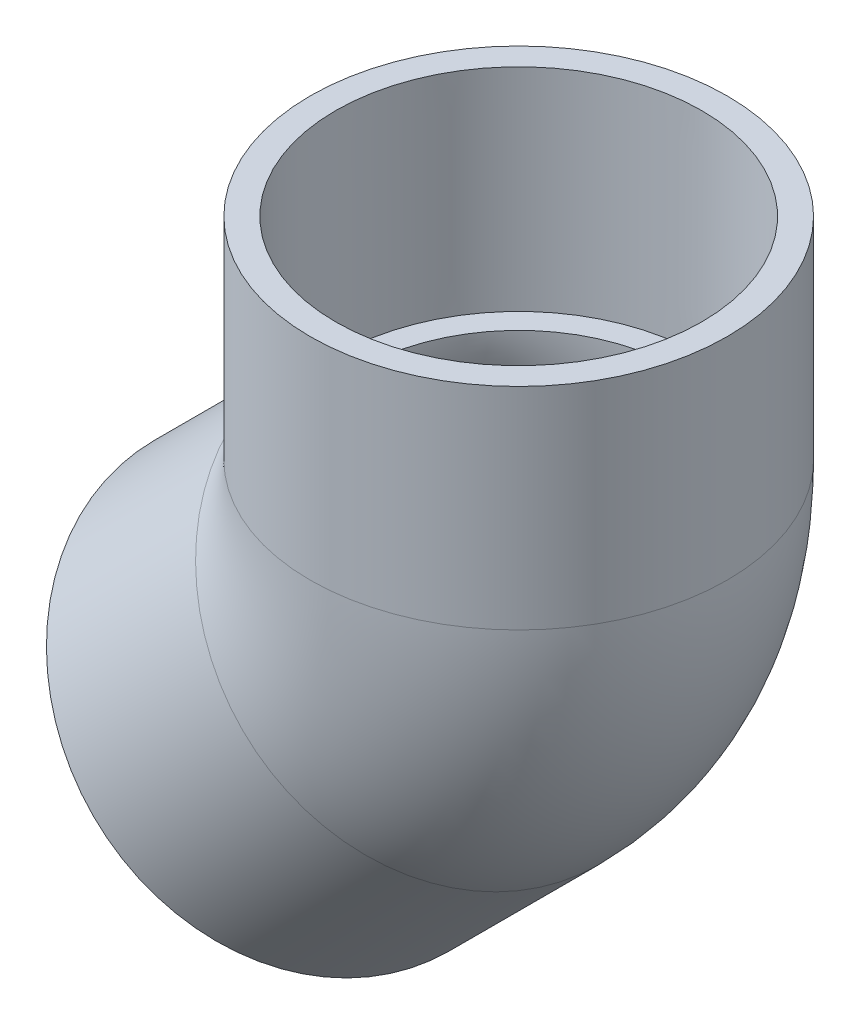
ISO-10303-21;
HEADER;
FILE_DESCRIPTION(('STEP AP214'),'2;1');
FILE_NAME('part.step','',(''),(''),'','','');
FILE_SCHEMA(('AUTOMOTIVE_DESIGN { 1 0 10303 214 1 1 1 1 }'));
ENDSEC;
DATA;
#1=APPLICATION_CONTEXT('core data for automotive mechanical design processes');
#2=APPLICATION_PROTOCOL_DEFINITION('international standard','automotive_design',2000,#1);
#3=PRODUCT_CONTEXT('',#1,'mechanical');
#4=PRODUCT('Part','Part','',(#3));
#5=PRODUCT_RELATED_PRODUCT_CATEGORY('part','',(#4));
#6=PRODUCT_DEFINITION_FORMATION('','',#4);
#7=PRODUCT_DEFINITION_CONTEXT('part definition',#1,'design');
#8=PRODUCT_DEFINITION('design','',#6,#7);
#9=PRODUCT_DEFINITION_SHAPE('','',#8);
#10=(LENGTH_UNIT() NAMED_UNIT(*) SI_UNIT(.MILLI.,.METRE.));
#11=(NAMED_UNIT(*) PLANE_ANGLE_UNIT() SI_UNIT($,.RADIAN.));
#12=(NAMED_UNIT(*) SI_UNIT($,.STERADIAN.) SOLID_ANGLE_UNIT());
#13=UNCERTAINTY_MEASURE_WITH_UNIT(LENGTH_MEASURE(1.E-05),#10,'distance_accuracy_value','');
#14=(GEOMETRIC_REPRESENTATION_CONTEXT(3) GLOBAL_UNCERTAINTY_ASSIGNED_CONTEXT((#13)) GLOBAL_UNIT_ASSIGNED_CONTEXT((#10,
#11,#12)) REPRESENTATION_CONTEXT('',''));
#15=CARTESIAN_POINT('',(0.,0.,0.));
#16=DIRECTION('',(0.,0.,1.));
#17=DIRECTION('',(1.,0.,0.));
#18=AXIS2_PLACEMENT_3D('',#15,#16,#17);
#19=CARTESIAN_POINT('',(-11.50595315512,-60.3360958134333,0.));
#20=DIRECTION('',(-0.707106781186549,-0.707106781186546,0.));
#21=DIRECTION('',(0.707106781186546,-0.707106781186549,0.));
#22=AXIS2_PLACEMENT_3D('',#19,#20,#21);
#23=PLANE('',#22);
#24=CARTESIAN_POINT('',(-35.9210244842767,-35.9210244842766,0.));
#25=DIRECTION('',(-0.707106781186549,-0.707106781186546,0.));
#26=DIRECTION('',(0.707106781186546,-0.707106781186549,0.));
#27=AXIS2_PLACEMENT_3D('',#24,#25,#26);
#28=CIRCLE('',#27,34.528125);
#29=CARTESIAN_POINT('',(-11.50595315512,-60.3360958134333,0.));
#30=VERTEX_POINT('',#29);
#31=EDGE_CURVE('E49',#30,#30,#28,.T.);
#32=ORIENTED_EDGE('',*,*,#31,.T.);
#33=EDGE_LOOP('',(#32));
#34=FACE_BOUND('',#33,.T.);
#35=CARTESIAN_POINT('',(-35.9210244842767,-35.9210244842766,0.));
#36=DIRECTION('',(-0.707106781186549,-0.707106781186546,0.));
#37=DIRECTION('',(0.707106781186546,-0.707106781186549,0.));
#38=AXIS2_PLACEMENT_3D('',#35,#36,#37);
#39=CIRCLE('',#38,30.3149);
#40=CARTESIAN_POINT('',(-14.4851531232846,-57.3568958452686,0.));
#41=VERTEX_POINT('',#40);
#42=EDGE_CURVE('E36',#41,#41,#39,.T.);
#43=ORIENTED_EDGE('',*,*,#42,.F.);
#44=EDGE_LOOP('',(#43));
#45=FACE_BOUND('',#44,.T.);
#46=ADVANCED_FACE('F30',(#34,#45),#23,.T.);
#47=CARTESIAN_POINT('',(-11.2253201513365,-11.2253201513364,0.));
#48=DIRECTION('',(-0.707106781186549,-0.707106781186546,0.));
#49=DIRECTION('',(0.707106781186546,-0.707106781186549,0.));
#50=AXIS2_PLACEMENT_3D('',#47,#48,#49);
#51=CONICAL_SURFACE('',#50,30.0863,0.00654536107227494);
#52=ORIENTED_EDGE('',*,*,#42,.T.);
#53=EDGE_LOOP('',(#52));
#54=FACE_BOUND('',#53,.T.);
#55=CARTESIAN_POINT('',(-11.2253201513365,-11.2253201513364,0.));
#56=DIRECTION('',(-0.707106781186549,-0.707106781186546,0.));
#57=DIRECTION('',(0.707106781186546,-0.707106781186549,0.));
#58=AXIS2_PLACEMENT_3D('',#55,#56,#57);
#59=CIRCLE('',#58,30.0863);
#60=CARTESIAN_POINT('',(10.0489065994763,-32.4995469021493,0.));
#61=VERTEX_POINT('',#60);
#62=EDGE_CURVE('E40',#61,#61,#59,.T.);
#63=ORIENTED_EDGE('',*,*,#62,.F.);
#64=EDGE_LOOP('',(#63));
#65=FACE_BOUND('',#64,.T.);
#66=ADVANCED_FACE('F81',(#54,#65),#51,.F.);
#67=CARTESIAN_POINT('',(-35.9210244842767,-35.9210244842766,0.));
#68=DIRECTION('',(-0.707106781186549,-0.707106781186546,0.));
#69=DIRECTION('',(0.707106781186546,-0.707106781186549,0.));
#70=AXIS2_PLACEMENT_3D('',#67,#68,#69);
#71=CYLINDRICAL_SURFACE('',#70,34.528125);
#72=CARTESIAN_POINT('',(-11.2253201513365,-11.2253201513364,0.));
#73=DIRECTION('',(-0.707106781186549,-0.707106781186546,0.));
#74=DIRECTION('',(0.707106781186546,-0.707106781186549,0.));
#75=AXIS2_PLACEMENT_3D('',#72,#73,#74);
#76=CIRCLE('',#75,34.528125);
#77=CARTESIAN_POINT('',(13.1897511778203,-35.6403914804932,0.));
#78=VERTEX_POINT('',#77);
#79=EDGE_CURVE('E44',#78,#78,#76,.T.);
#80=ORIENTED_EDGE('',*,*,#79,.T.);
#81=EDGE_LOOP('',(#80));
#82=FACE_BOUND('',#81,.T.);
#83=ORIENTED_EDGE('',*,*,#31,.F.);
#84=EDGE_LOOP('',(#83));
#85=FACE_BOUND('',#84,.T.);
#86=ADVANCED_FACE('F86',(#82,#85),#71,.T.);
#87=CARTESIAN_POINT('',(-38.3256403026728,15.875,0.));
#88=DIRECTION('',(0.,0.,-1.));
#89=DIRECTION('',(-1.,0.,0.));
#90=AXIS2_PLACEMENT_3D('',#87,#88,#89);
#91=TOROIDAL_SURFACE('',#90,38.3256403026728,26.2509);
#92=CARTESIAN_POINT('',(0.,15.875,0.));
#93=DIRECTION('',(0.,1.,0.));
#94=DIRECTION('',(-1.,0.,0.));
#95=AXIS2_PLACEMENT_3D('',#92,#93,#94);
#96=CIRCLE('',#95,26.2509);
#97=CARTESIAN_POINT('',(26.2509,15.875,0.));
#98=VERTEX_POINT('',#97);
#99=EDGE_CURVE('E55',#98,#98,#96,.T.);
#100=CARTESIAN_POINT('',(-11.2253201513365,-11.2253201513364,0.));
#101=DIRECTION('',(0.707106781186549,0.707106781186546,0.));
#102=DIRECTION('',(-0.707106781186546,0.707106781186549,0.));
#103=AXIS2_PLACEMENT_3D('',#100,#101,#102);
#104=CIRCLE('',#103,26.2509);
#105=CARTESIAN_POINT('',(7.33686925091345,-29.7875095535864,0.));
#106=VERTEX_POINT('',#105);
#107=EDGE_CURVE('E58',#106,#106,#104,.T.);
#108=CARTESIAN_POINT('',(-38.3256403026728,15.875,0.));
#109=DIRECTION('',(0.,0.,-1.));
#110=DIRECTION('',(-1.,0.,0.));
#111=AXIS2_PLACEMENT_3D('',#108,#109,#110);
#112=CIRCLE('',#111,64.5765403026728);
#113=EDGE_CURVE('',#98,#106,#112,.T.);
#114=ORIENTED_EDGE('',*,*,#99,.T.);
#115=ORIENTED_EDGE('',*,*,#107,.F.);
#116=ORIENTED_EDGE('',*,*,#113,.T.);
#117=ORIENTED_EDGE('',*,*,#113,.F.);
#118=EDGE_LOOP('',(#114,#116,#115,#117));
#119=FACE_BOUND('',#118,.T.);
#120=ADVANCED_FACE('F91',(#119),#91,.F.);
#121=CARTESIAN_POINT('',(-38.3256403026728,15.875,0.));
#122=DIRECTION('',(0.,0.,-1.));
#123=DIRECTION('',(-1.,0.,0.));
#124=AXIS2_PLACEMENT_3D('',#121,#122,#123);
#125=TOROIDAL_SURFACE('',#124,38.3256403026728,34.528125);
#126=CARTESIAN_POINT('',(0.,15.875,0.));
#127=DIRECTION('',(0.,1.,0.));
#128=DIRECTION('',(-1.,0.,0.));
#129=AXIS2_PLACEMENT_3D('',#126,#127,#128);
#130=CIRCLE('',#129,34.528125);
#131=CARTESIAN_POINT('',(34.528125,15.875,0.));
#132=VERTEX_POINT('',#131);
#133=EDGE_CURVE('E52',#132,#132,#130,.T.);
#134=CARTESIAN_POINT('',(-38.3256403026728,15.875,0.));
#135=DIRECTION('',(0.,0.,-1.));
#136=DIRECTION('',(-1.,0.,0.));
#137=AXIS2_PLACEMENT_3D('',#134,#135,#136);
#138=CIRCLE('',#137,72.8537653026728);
#139=EDGE_CURVE('',#132,#78,#138,.T.);
#140=ORIENTED_EDGE('',*,*,#133,.F.);
#141=ORIENTED_EDGE('',*,*,#79,.F.);
#142=ORIENTED_EDGE('',*,*,#139,.T.);
#143=ORIENTED_EDGE('',*,*,#139,.F.);
#144=EDGE_LOOP('',(#140,#142,#141,#143));
#145=FACE_BOUND('',#144,.T.);
#146=ADVANCED_FACE('F97',(#145),#125,.T.);
#147=CARTESIAN_POINT('',(0.,15.875,0.));
#148=DIRECTION('',(0.,1.,0.));
#149=DIRECTION('',(-1.,0.,0.));
#150=AXIS2_PLACEMENT_3D('',#147,#148,#149);
#151=PLANE('',#150);
#152=CARTESIAN_POINT('',(0.,15.875,0.));
#153=DIRECTION('',(0.,1.,0.));
#154=DIRECTION('',(-1.,0.,0.));
#155=AXIS2_PLACEMENT_3D('',#152,#153,#154);
#156=CIRCLE('',#155,30.0863);
#157=CARTESIAN_POINT('',(-30.0863,15.875,0.));
#158=VERTEX_POINT('',#157);
#159=EDGE_CURVE('E10',#158,#158,#156,.F.);
#160=ORIENTED_EDGE('',*,*,#159,.F.);
#161=EDGE_LOOP('',(#160));
#162=FACE_BOUND('',#161,.T.);
#163=ORIENTED_EDGE('',*,*,#99,.F.);
#164=EDGE_LOOP('',(#163));
#165=FACE_BOUND('',#164,.T.);
#166=ADVANCED_FACE('F102',(#162,#165),#151,.T.);
#167=CARTESIAN_POINT('',(-11.2253201513365,-11.2253201513364,0.));
#168=DIRECTION('',(0.707106781186549,0.707106781186546,0.));
#169=DIRECTION('',(-0.707106781186546,0.707106781186549,0.));
#170=AXIS2_PLACEMENT_3D('',#167,#168,#169);
#171=PLANE('',#170);
#172=ORIENTED_EDGE('',*,*,#62,.T.);
#173=EDGE_LOOP('',(#172));
#174=FACE_BOUND('',#173,.T.);
#175=ORIENTED_EDGE('',*,*,#107,.T.);
#176=EDGE_LOOP('',(#175));
#177=FACE_BOUND('',#176,.T.);
#178=ADVANCED_FACE('F107',(#174,#177),#171,.F.);
#179=CARTESIAN_POINT('',(34.528125,50.8,0.));
#180=DIRECTION('',(0.,1.,0.));
#181=DIRECTION('',(0.,0.,1.));
#182=AXIS2_PLACEMENT_3D('',#179,#180,#181);
#183=PLANE('',#182);
#184=CARTESIAN_POINT('',(0.,50.8,0.));
#185=DIRECTION('',(0.,-1.,0.));
#186=DIRECTION('',(0.,0.,-1.));
#187=AXIS2_PLACEMENT_3D('',#184,#185,#186);
#188=CIRCLE('',#187,30.3149);
#189=CARTESIAN_POINT('',(0.,50.8,-30.3149));
#190=VERTEX_POINT('',#189);
#191=EDGE_CURVE('E64',#190,#190,#188,.T.);
#192=ORIENTED_EDGE('',*,*,#191,.T.);
#193=EDGE_LOOP('',(#192));
#194=FACE_BOUND('',#193,.T.);
#195=CARTESIAN_POINT('',(0.,50.8,0.));
#196=DIRECTION('',(0.,-1.,0.));
#197=DIRECTION('',(0.,0.,-1.));
#198=AXIS2_PLACEMENT_3D('',#195,#196,#197);
#199=CIRCLE('',#198,34.528125);
#200=CARTESIAN_POINT('',(0.,50.8,-34.528125));
#201=VERTEX_POINT('',#200);
#202=EDGE_CURVE('E61',#201,#201,#199,.T.);
#203=ORIENTED_EDGE('',*,*,#202,.F.);
#204=EDGE_LOOP('',(#203));
#205=FACE_BOUND('',#204,.T.);
#206=ADVANCED_FACE('F68',(#194,#205),#183,.T.);
#207=CARTESIAN_POINT('',(0.,0.,0.));
#208=DIRECTION('',(0.,-1.,0.));
#209=DIRECTION('',(0.,0.,-1.));
#210=AXIS2_PLACEMENT_3D('',#207,#208,#209);
#211=CYLINDRICAL_SURFACE('',#210,34.528125);
#212=ORIENTED_EDGE('',*,*,#202,.T.);
#213=EDGE_LOOP('',(#212));
#214=FACE_BOUND('',#213,.T.);
#215=ORIENTED_EDGE('',*,*,#133,.T.);
#216=EDGE_LOOP('',(#215));
#217=FACE_BOUND('',#216,.T.);
#218=ADVANCED_FACE('F73',(#214,#217),#211,.T.);
#219=CARTESIAN_POINT('',(0.,50.8,0.));
#220=DIRECTION('',(0.,1.,0.));
#221=DIRECTION('',(0.,0.,1.));
#222=AXIS2_PLACEMENT_3D('',#219,#220,#221);
#223=CONICAL_SURFACE('',#222,30.3149,0.00654536107227504);
#224=ORIENTED_EDGE('',*,*,#159,.T.);
#225=EDGE_LOOP('',(#224));
#226=FACE_BOUND('',#225,.T.);
#227=ORIENTED_EDGE('',*,*,#191,.F.);
#228=EDGE_LOOP('',(#227));
#229=FACE_BOUND('',#228,.T.);
#230=ADVANCED_FACE('F71',(#226,#229),#223,.F.);
#231=CLOSED_SHELL('',(#46,#66,#86,#120,#146,#166,#178,#206,#218,#230));
#232=MANIFOLD_SOLID_BREP('B2',#231);
#233=ADVANCED_BREP_SHAPE_REPRESENTATION('',(#18,#232),#14);
#234=SHAPE_DEFINITION_REPRESENTATION(#9,#233);
ENDSEC;
END-ISO-10303-21;
